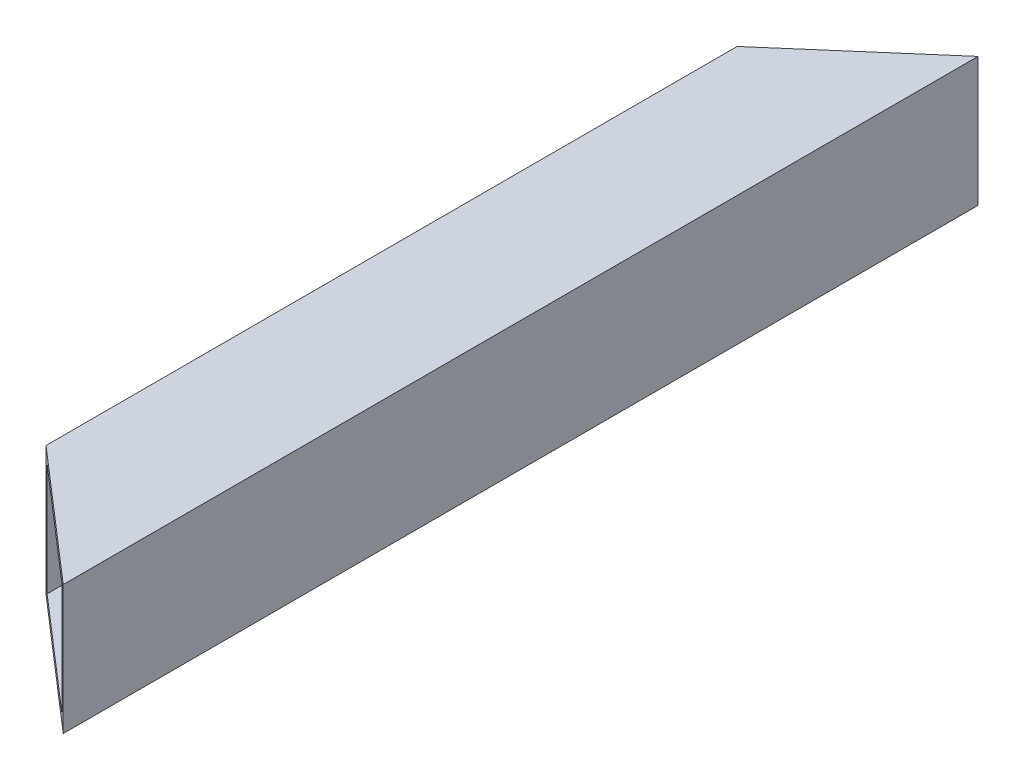
ISO-10303-21;
HEADER;
FILE_DESCRIPTION(('STEP AP214'),'2;1');
FILE_NAME('part.step','',(''),(''),'','','');
FILE_SCHEMA(('AUTOMOTIVE_DESIGN { 1 0 10303 214 1 1 1 1 }'));
ENDSEC;
DATA;
#1=APPLICATION_CONTEXT('core data for automotive mechanical design processes');
#2=APPLICATION_PROTOCOL_DEFINITION('international standard','automotive_design',2000,#1);
#3=PRODUCT_CONTEXT('',#1,'mechanical');
#4=PRODUCT('Part','Part','',(#3));
#5=PRODUCT_RELATED_PRODUCT_CATEGORY('part','',(#4));
#6=PRODUCT_DEFINITION_FORMATION('','',#4);
#7=PRODUCT_DEFINITION_CONTEXT('part definition',#1,'design');
#8=PRODUCT_DEFINITION('design','',#6,#7);
#9=PRODUCT_DEFINITION_SHAPE('','',#8);
#10=(LENGTH_UNIT() NAMED_UNIT(*) SI_UNIT(.MILLI.,.METRE.));
#11=(NAMED_UNIT(*) PLANE_ANGLE_UNIT() SI_UNIT($,.RADIAN.));
#12=(NAMED_UNIT(*) SI_UNIT($,.STERADIAN.) SOLID_ANGLE_UNIT());
#13=UNCERTAINTY_MEASURE_WITH_UNIT(LENGTH_MEASURE(1.E-05),#10,'distance_accuracy_value','');
#14=(GEOMETRIC_REPRESENTATION_CONTEXT(3) GLOBAL_UNCERTAINTY_ASSIGNED_CONTEXT((#13)) GLOBAL_UNIT_ASSIGNED_CONTEXT((#10,
#11,#12)) REPRESENTATION_CONTEXT('',''));
#15=CARTESIAN_POINT('',(0.,0.,0.));
#16=DIRECTION('',(0.,0.,1.));
#17=DIRECTION('',(1.,0.,0.));
#18=AXIS2_PLACEMENT_3D('',#15,#16,#17);
#19=CARTESIAN_POINT('',(-12.7,12.7,158.037119511542));
#20=DIRECTION('',(1.,0.,0.));
#21=DIRECTION('',(0.,0.,-1.));
#22=AXIS2_PLACEMENT_3D('',#19,#20,#21);
#23=PLANE('',#22);
#24=DIRECTION('',(0.,0.,-1.));
#25=VECTOR('',#24,1.);
#26=CARTESIAN_POINT('',(-12.7,-12.7,158.037119511542));
#27=LINE('',#26,#25);
#28=CARTESIAN_POINT('',(-12.7,-12.7,147.03409438467));
#29=VERTEX_POINT('',#28);
#30=CARTESIAN_POINT('',(-12.7,-12.7,11.0025190919103));
#31=VERTEX_POINT('',#30);
#32=EDGE_CURVE('E118',#29,#31,#27,.T.);
#33=ORIENTED_EDGE('',*,*,#32,.F.);
#34=DIRECTION('',(0.,1.,0.));
#35=VECTOR('',#34,1.);
#36=CARTESIAN_POINT('',(-12.7,12.7,147.03409438467));
#37=LINE('',#36,#35);
#38=CARTESIAN_POINT('',(-12.7,12.7,147.03409438467));
#39=VERTEX_POINT('',#38);
#40=EDGE_CURVE('E99',#29,#39,#37,.T.);
#41=ORIENTED_EDGE('',*,*,#40,.T.);
#42=DIRECTION('',(0.,0.,-1.));
#43=VECTOR('',#42,1.);
#44=CARTESIAN_POINT('',(-12.7,12.7,158.037119511542));
#45=LINE('',#44,#43);
#46=CARTESIAN_POINT('',(-12.7,12.7,11.0025190919103));
#47=VERTEX_POINT('',#46);
#48=EDGE_CURVE('E121',#39,#47,#45,.T.);
#49=ORIENTED_EDGE('',*,*,#48,.T.);
#50=DIRECTION('',(0.,-1.,0.));
#51=VECTOR('',#50,1.);
#52=CARTESIAN_POINT('',(-12.7,12.7,11.0025190919102));
#53=LINE('',#52,#51);
#54=EDGE_CURVE('E155',#47,#31,#53,.T.);
#55=ORIENTED_EDGE('',*,*,#54,.T.);
#56=EDGE_LOOP('',(#33,#41,#49,#55));
#57=FACE_BOUND('',#56,.T.);
#58=ADVANCED_FACE('F35',(#57),#23,.F.);
#59=CARTESIAN_POINT('',(12.7,-12.7,158.037119511542));
#60=DIRECTION('',(0.,1.,0.));
#61=DIRECTION('',(-1.,0.,0.));
#62=AXIS2_PLACEMENT_3D('',#59,#60,#61);
#63=PLANE('',#62);
#64=DIRECTION('',(0.,0.,-1.));
#65=VECTOR('',#64,1.);
#66=CARTESIAN_POINT('',(12.7,-12.7,158.037119511542));
#67=LINE('',#66,#65);
#68=CARTESIAN_POINT('',(12.7,-12.7,169.040144638414));
#69=VERTEX_POINT('',#68);
#70=CARTESIAN_POINT('',(12.7,-12.7,-11.0025190919103));
#71=VERTEX_POINT('',#70);
#72=EDGE_CURVE('E109',#69,#71,#67,.T.);
#73=ORIENTED_EDGE('',*,*,#72,.F.);
#74=DIRECTION('',(-0.755796329374919,0.,-0.654806771882667));
#75=VECTOR('',#74,1.);
#76=CARTESIAN_POINT('',(-78.212658099774,-12.7,90.2752421641984));
#77=LINE('',#76,#75);
#78=EDGE_CURVE('E96',#69,#29,#77,.T.);
#79=ORIENTED_EDGE('',*,*,#78,.T.);
#80=ORIENTED_EDGE('',*,*,#32,.T.);
#81=DIRECTION('',(0.755811233359076,0.,-0.654789568890825));
#82=VECTOR('',#81,1.);
#83=CARTESIAN_POINT('',(42.1408569726312,-12.7,-36.5083136528216));
#84=LINE('',#83,#82);
#85=EDGE_CURVE('E117',#31,#71,#84,.T.);
#86=ORIENTED_EDGE('',*,*,#85,.T.);
#87=EDGE_LOOP('',(#73,#79,#80,#86));
#88=FACE_BOUND('',#87,.T.);
#89=ADVANCED_FACE('F115',(#88),#63,.F.);
#90=CARTESIAN_POINT('',(12.7,12.7,158.037119511542));
#91=DIRECTION('',(-1.,0.,0.));
#92=DIRECTION('',(0.,-1.,0.));
#93=AXIS2_PLACEMENT_3D('',#90,#91,#92);
#94=PLANE('',#93);
#95=DIRECTION('',(0.,0.,-1.));
#96=VECTOR('',#95,1.);
#97=CARTESIAN_POINT('',(12.7,12.7,158.037119511542));
#98=LINE('',#97,#96);
#99=CARTESIAN_POINT('',(12.7,12.7,169.040144638414));
#100=VERTEX_POINT('',#99);
#101=CARTESIAN_POINT('',(12.7,12.7,-11.0025190919103));
#102=VERTEX_POINT('',#101);
#103=EDGE_CURVE('E111',#100,#102,#98,.T.);
#104=ORIENTED_EDGE('',*,*,#103,.F.);
#105=DIRECTION('',(0.,-1.,0.));
#106=VECTOR('',#105,1.);
#107=CARTESIAN_POINT('',(12.7,12.7,169.040144638414));
#108=LINE('',#107,#106);
#109=EDGE_CURVE('E49',#100,#69,#108,.T.);
#110=ORIENTED_EDGE('',*,*,#109,.T.);
#111=ORIENTED_EDGE('',*,*,#72,.T.);
#112=DIRECTION('',(0.,1.,0.));
#113=VECTOR('',#112,1.);
#114=CARTESIAN_POINT('',(12.7,12.7,-11.0025190919103));
#115=LINE('',#114,#113);
#116=EDGE_CURVE('E149',#71,#102,#115,.T.);
#117=ORIENTED_EDGE('',*,*,#116,.T.);
#118=EDGE_LOOP('',(#104,#110,#111,#117));
#119=FACE_BOUND('',#118,.T.);
#120=ADVANCED_FACE('F107',(#119),#94,.F.);
#121=CARTESIAN_POINT('',(12.7,12.7,158.037119511542));
#122=DIRECTION('',(0.,-1.,0.));
#123=DIRECTION('',(1.,0.,0.));
#124=AXIS2_PLACEMENT_3D('',#121,#122,#123);
#125=PLANE('',#124);
#126=ORIENTED_EDGE('',*,*,#48,.F.);
#127=DIRECTION('',(0.755796329374919,0.,0.654806771882667));
#128=VECTOR('',#127,1.);
#129=CARTESIAN_POINT('',(7.2545967620068,12.7,164.322356555454));
#130=LINE('',#129,#128);
#131=EDGE_CURVE('E112',#39,#100,#130,.T.);
#132=ORIENTED_EDGE('',*,*,#131,.T.);
#133=ORIENTED_EDGE('',*,*,#103,.T.);
#134=DIRECTION('',(-0.755811233359076,0.,0.654789568890825));
#135=VECTOR('',#134,1.);
#136=CARTESIAN_POINT('',(-70.9572627078176,12.7,61.4731210749965));
#137=LINE('',#136,#135);
#138=EDGE_CURVE('E145',#102,#47,#137,.T.);
#139=ORIENTED_EDGE('',*,*,#138,.T.);
#140=EDGE_LOOP('',(#126,#132,#133,#139));
#141=FACE_BOUND('',#140,.T.);
#142=ADVANCED_FACE('F168',(#141),#125,.F.);
#143=CARTESIAN_POINT('',(-11.049,11.049,158.037119511542));
#144=DIRECTION('',(1.,0.,0.));
#145=DIRECTION('',(0.,1.,0.));
#146=AXIS2_PLACEMENT_3D('',#143,#144,#145);
#147=PLANE('',#146);
#148=DIRECTION('',(0.,1.,0.));
#149=VECTOR('',#148,1.);
#150=CARTESIAN_POINT('',(-11.049,11.049,148.464487651163));
#151=LINE('',#150,#149);
#152=CARTESIAN_POINT('',(-11.049,-11.049,148.464487651163));
#153=VERTEX_POINT('',#152);
#154=CARTESIAN_POINT('',(-11.049,11.049,148.464487651163));
#155=VERTEX_POINT('',#154);
#156=EDGE_CURVE('E56',#153,#155,#151,.T.);
#157=ORIENTED_EDGE('',*,*,#156,.F.);
#158=DIRECTION('',(0.,0.,-1.));
#159=VECTOR('',#158,1.);
#160=CARTESIAN_POINT('',(-11.049,-11.049,158.037119511542));
#161=LINE('',#160,#159);
#162=CARTESIAN_POINT('',(-11.049,-11.049,9.57219160996192));
#163=VERTEX_POINT('',#162);
#164=EDGE_CURVE('E144',#153,#163,#161,.T.);
#165=ORIENTED_EDGE('',*,*,#164,.T.);
#166=DIRECTION('',(0.,-1.,0.));
#167=VECTOR('',#166,1.);
#168=CARTESIAN_POINT('',(-11.049,11.049,9.57219160996189));
#169=LINE('',#168,#167);
#170=CARTESIAN_POINT('',(-11.049,11.049,9.57219160996192));
#171=VERTEX_POINT('',#170);
#172=EDGE_CURVE('E133',#171,#163,#169,.T.);
#173=ORIENTED_EDGE('',*,*,#172,.F.);
#174=DIRECTION('',(0.,0.,-1.));
#175=VECTOR('',#174,1.);
#176=CARTESIAN_POINT('',(-11.049,11.049,158.037119511542));
#177=LINE('',#176,#175);
#178=EDGE_CURVE('E142',#155,#171,#177,.T.);
#179=ORIENTED_EDGE('',*,*,#178,.F.);
#180=EDGE_LOOP('',(#157,#165,#173,#179));
#181=FACE_BOUND('',#180,.T.);
#182=ADVANCED_FACE('F141',(#181),#147,.T.);
#183=CARTESIAN_POINT('',(11.049,-11.049,158.037119511542));
#184=DIRECTION('',(0.,1.,0.));
#185=DIRECTION('',(-1.,0.,0.));
#186=AXIS2_PLACEMENT_3D('',#183,#184,#185);
#187=PLANE('',#186);
#188=DIRECTION('',(-0.755796329374919,0.,-0.654806771882667));
#189=VECTOR('',#188,1.);
#190=CARTESIAN_POINT('',(6.31149918294591,-11.049,163.505275739746));
#191=LINE('',#190,#189);
#192=CARTESIAN_POINT('',(11.049,-11.049,167.609751371921));
#193=VERTEX_POINT('',#192);
#194=EDGE_CURVE('E170',#193,#153,#191,.T.);
#195=ORIENTED_EDGE('',*,*,#194,.F.);
#196=DIRECTION('',(0.,0.,-1.));
#197=VECTOR('',#196,1.);
#198=CARTESIAN_POINT('',(11.049,-11.049,158.037119511542));
#199=LINE('',#198,#197);
#200=CARTESIAN_POINT('',(11.049,-11.049,-9.57219160996192));
#201=VERTEX_POINT('',#200);
#202=EDGE_CURVE('E161',#193,#201,#199,.T.);
#203=ORIENTED_EDGE('',*,*,#202,.T.);
#204=DIRECTION('',(0.755811233359076,0.,-0.654789568890825));
#205=VECTOR('',#204,1.);
#206=CARTESIAN_POINT('',(-71.9003974822165,-11.049,62.2901965365373));
#207=LINE('',#206,#205);
#208=EDGE_CURVE('E146',#163,#201,#207,.T.);
#209=ORIENTED_EDGE('',*,*,#208,.F.);
#210=ORIENTED_EDGE('',*,*,#164,.F.);
#211=EDGE_LOOP('',(#195,#203,#209,#210));
#212=FACE_BOUND('',#211,.T.);
#213=ADVANCED_FACE('F181',(#212),#187,.T.);
#214=CARTESIAN_POINT('',(11.049,11.049,158.037119511542));
#215=DIRECTION('',(-1.,0.,0.));
#216=DIRECTION('',(0.,-1.,0.));
#217=AXIS2_PLACEMENT_3D('',#214,#215,#216);
#218=PLANE('',#217);
#219=DIRECTION('',(0.,-1.,0.));
#220=VECTOR('',#219,1.);
#221=CARTESIAN_POINT('',(11.049,11.049,167.609751371921));
#222=LINE('',#221,#220);
#223=CARTESIAN_POINT('',(11.049,11.049,167.609751371921));
#224=VERTEX_POINT('',#223);
#225=EDGE_CURVE('E103',#224,#193,#222,.T.);
#226=ORIENTED_EDGE('',*,*,#225,.F.);
#227=DIRECTION('',(0.,0.,-1.));
#228=VECTOR('',#227,1.);
#229=CARTESIAN_POINT('',(11.049,11.049,158.037119511542));
#230=LINE('',#229,#228);
#231=CARTESIAN_POINT('',(11.049,11.049,-9.57219160996191));
#232=VERTEX_POINT('',#231);
#233=EDGE_CURVE('E159',#224,#232,#230,.T.);
#234=ORIENTED_EDGE('',*,*,#233,.T.);
#235=DIRECTION('',(0.,1.,0.));
#236=VECTOR('',#235,1.);
#237=CARTESIAN_POINT('',(11.049,11.049,-9.57219160996192));
#238=LINE('',#237,#236);
#239=EDGE_CURVE('E136',#201,#232,#238,.T.);
#240=ORIENTED_EDGE('',*,*,#239,.F.);
#241=ORIENTED_EDGE('',*,*,#202,.F.);
#242=EDGE_LOOP('',(#226,#234,#240,#241));
#243=FACE_BOUND('',#242,.T.);
#244=ADVANCED_FACE('F182',(#243),#218,.T.);
#245=CARTESIAN_POINT('',(11.049,11.049,158.037119511542));
#246=DIRECTION('',(0.,-1.,0.));
#247=DIRECTION('',(1.,0.,0.));
#248=AXIS2_PLACEMENT_3D('',#245,#246,#247);
#249=PLANE('',#248);
#250=DIRECTION('',(0.755796329374919,0.,0.654806771882667));
#251=VECTOR('',#250,1.);
#252=CARTESIAN_POINT('',(6.31149918294591,11.049,163.505275739746));
#253=LINE('',#252,#251);
#254=EDGE_CURVE('E11',#155,#224,#253,.T.);
#255=ORIENTED_EDGE('',*,*,#254,.F.);
#256=ORIENTED_EDGE('',*,*,#178,.T.);
#257=DIRECTION('',(-0.755811233359076,0.,0.654789568890825));
#258=VECTOR('',#257,1.);
#259=CARTESIAN_POINT('',(-71.9003974822165,11.049,62.2901965365373));
#260=LINE('',#259,#258);
#261=EDGE_CURVE('E42',#232,#171,#260,.T.);
#262=ORIENTED_EDGE('',*,*,#261,.F.);
#263=ORIENTED_EDGE('',*,*,#233,.F.);
#264=EDGE_LOOP('',(#255,#256,#262,#263));
#265=FACE_BOUND('',#264,.T.);
#266=ADVANCED_FACE('F183',(#265),#249,.T.);
#267=CARTESIAN_POINT('',(42.1408569726312,-12.7,-36.5083136528216));
#268=DIRECTION('',(0.654789568890825,0.,0.755811233359076));
#269=DIRECTION('',(0.755811233359076,0.,-0.654789568890825));
#270=AXIS2_PLACEMENT_3D('',#267,#268,#269);
#271=PLANE('',#270);
#272=ORIENTED_EDGE('',*,*,#172,.T.);
#273=ORIENTED_EDGE('',*,*,#208,.T.);
#274=ORIENTED_EDGE('',*,*,#239,.T.);
#275=ORIENTED_EDGE('',*,*,#261,.T.);
#276=EDGE_LOOP('',(#272,#273,#274,#275));
#277=FACE_BOUND('',#276,.T.);
#278=ORIENTED_EDGE('',*,*,#138,.F.);
#279=ORIENTED_EDGE('',*,*,#116,.F.);
#280=ORIENTED_EDGE('',*,*,#85,.F.);
#281=ORIENTED_EDGE('',*,*,#54,.F.);
#282=EDGE_LOOP('',(#278,#279,#280,#281));
#283=FACE_BOUND('',#282,.T.);
#284=ADVANCED_FACE('F130',(#277,#283),#271,.F.);
#285=CARTESIAN_POINT('',(-78.212658099774,-12.7,90.2752421641984));
#286=DIRECTION('',(0.654806771882667,0.,-0.755796329374919));
#287=DIRECTION('',(-0.755796329374919,0.,-0.654806771882667));
#288=AXIS2_PLACEMENT_3D('',#285,#286,#287);
#289=PLANE('',#288);
#290=ORIENTED_EDGE('',*,*,#156,.T.);
#291=ORIENTED_EDGE('',*,*,#254,.T.);
#292=ORIENTED_EDGE('',*,*,#225,.T.);
#293=ORIENTED_EDGE('',*,*,#194,.T.);
#294=EDGE_LOOP('',(#290,#291,#292,#293));
#295=FACE_BOUND('',#294,.T.);
#296=ORIENTED_EDGE('',*,*,#78,.F.);
#297=ORIENTED_EDGE('',*,*,#109,.F.);
#298=ORIENTED_EDGE('',*,*,#131,.F.);
#299=ORIENTED_EDGE('',*,*,#40,.F.);
#300=EDGE_LOOP('',(#296,#297,#298,#299));
#301=FACE_BOUND('',#300,.T.);
#302=ADVANCED_FACE('F97',(#295,#301),#289,.F.);
#303=CLOSED_SHELL('',(#58,#89,#120,#142,#182,#213,#244,#266,#284,#302));
#304=MANIFOLD_SOLID_BREP('B2',#303);
#305=ADVANCED_BREP_SHAPE_REPRESENTATION('',(#18,#304),#14);
#306=SHAPE_DEFINITION_REPRESENTATION(#9,#305);
ENDSEC;
END-ISO-10303-21;
